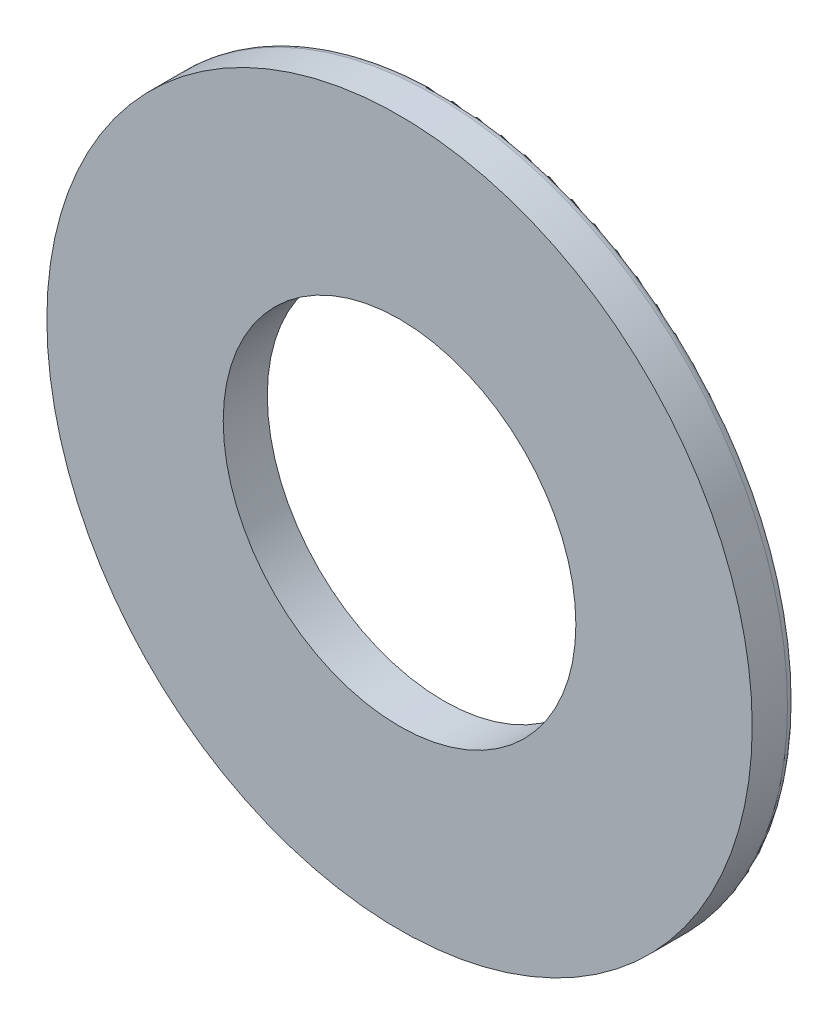
ISO-10303-21;
HEADER;
FILE_DESCRIPTION(('STEP AP214'),'2;1');
FILE_NAME('part.step','',(''),(''),'','','');
FILE_SCHEMA(('AUTOMOTIVE_DESIGN { 1 0 10303 214 1 1 1 1 }'));
ENDSEC;
DATA;
#1=APPLICATION_CONTEXT('core data for automotive mechanical design processes');
#2=APPLICATION_PROTOCOL_DEFINITION('international standard','automotive_design',2000,#1);
#3=PRODUCT_CONTEXT('',#1,'mechanical');
#4=PRODUCT('Part','Part','',(#3));
#5=PRODUCT_RELATED_PRODUCT_CATEGORY('part','',(#4));
#6=PRODUCT_DEFINITION_FORMATION('','',#4);
#7=PRODUCT_DEFINITION_CONTEXT('part definition',#1,'design');
#8=PRODUCT_DEFINITION('design','',#6,#7);
#9=PRODUCT_DEFINITION_SHAPE('','',#8);
#10=(LENGTH_UNIT() NAMED_UNIT(*) SI_UNIT(.MILLI.,.METRE.));
#11=(NAMED_UNIT(*) PLANE_ANGLE_UNIT() SI_UNIT($,.RADIAN.));
#12=(NAMED_UNIT(*) SI_UNIT($,.STERADIAN.) SOLID_ANGLE_UNIT());
#13=UNCERTAINTY_MEASURE_WITH_UNIT(LENGTH_MEASURE(1.E-05),#10,'distance_accuracy_value','');
#14=(GEOMETRIC_REPRESENTATION_CONTEXT(3) GLOBAL_UNCERTAINTY_ASSIGNED_CONTEXT((#13)) GLOBAL_UNIT_ASSIGNED_CONTEXT((#10,
#11,#12)) REPRESENTATION_CONTEXT('',''));
#15=CARTESIAN_POINT('',(0.,0.,0.));
#16=DIRECTION('',(0.,0.,1.));
#17=DIRECTION('',(1.,0.,0.));
#18=AXIS2_PLACEMENT_3D('',#15,#16,#17);
#19=CARTESIAN_POINT('',(0.,0.,0.25));
#20=DIRECTION('',(0.,0.,1.));
#21=DIRECTION('',(1.,0.,0.));
#22=AXIS2_PLACEMENT_3D('',#19,#20,#21);
#23=PLANE('',#22);
#24=CARTESIAN_POINT('',(0.,0.,0.25));
#25=DIRECTION('',(0.,0.,1.));
#26=DIRECTION('',(1.,0.,0.));
#27=AXIS2_PLACEMENT_3D('',#24,#25,#26);
#28=CIRCLE('',#27,2.);
#29=CARTESIAN_POINT('',(2.,0.,0.25));
#30=VERTEX_POINT('',#29);
#31=EDGE_CURVE('E42',#30,#30,#28,.T.);
#32=ORIENTED_EDGE('',*,*,#31,.T.);
#33=EDGE_LOOP('',(#32));
#34=FACE_BOUND('',#33,.T.);
#35=CARTESIAN_POINT('',(0.,0.,0.25));
#36=DIRECTION('',(0.,0.,1.));
#37=DIRECTION('',(1.,0.,0.));
#38=AXIS2_PLACEMENT_3D('',#35,#36,#37);
#39=CIRCLE('',#38,1.);
#40=CARTESIAN_POINT('',(1.,0.,0.25));
#41=VERTEX_POINT('',#40);
#42=EDGE_CURVE('E46',#41,#41,#39,.T.);
#43=ORIENTED_EDGE('',*,*,#42,.F.);
#44=EDGE_LOOP('',(#43));
#45=FACE_BOUND('',#44,.T.);
#46=ADVANCED_FACE('F31',(#34,#45),#23,.T.);
#47=CARTESIAN_POINT('',(0.,0.,0.));
#48=DIRECTION('',(0.,0.,1.));
#49=DIRECTION('',(1.,0.,0.));
#50=AXIS2_PLACEMENT_3D('',#47,#48,#49);
#51=PLANE('',#50);
#52=CARTESIAN_POINT('',(0.,0.,0.));
#53=DIRECTION('',(0.,0.,1.));
#54=DIRECTION('',(1.,0.,0.));
#55=AXIS2_PLACEMENT_3D('',#52,#53,#54);
#56=CIRCLE('',#55,1.95);
#57=CARTESIAN_POINT('',(1.95,0.,0.));
#58=VERTEX_POINT('',#57);
#59=EDGE_CURVE('E10',#58,#58,#56,.F.);
#60=ORIENTED_EDGE('',*,*,#59,.T.);
#61=EDGE_LOOP('',(#60));
#62=FACE_BOUND('',#61,.T.);
#63=CARTESIAN_POINT('',(0.,0.,0.));
#64=DIRECTION('',(0.,0.,1.));
#65=DIRECTION('',(1.,0.,0.));
#66=AXIS2_PLACEMENT_3D('',#63,#64,#65);
#67=CIRCLE('',#66,1.);
#68=CARTESIAN_POINT('',(1.,0.,0.));
#69=VERTEX_POINT('',#68);
#70=EDGE_CURVE('E49',#69,#69,#67,.T.);
#71=ORIENTED_EDGE('',*,*,#70,.T.);
#72=EDGE_LOOP('',(#71));
#73=FACE_BOUND('',#72,.T.);
#74=ADVANCED_FACE('F59',(#62,#73),#51,.F.);
#75=CARTESIAN_POINT('',(0.,0.,0.25));
#76=DIRECTION('',(0.,0.,-1.));
#77=DIRECTION('',(-1.,0.,0.));
#78=AXIS2_PLACEMENT_3D('',#75,#76,#77);
#79=CYLINDRICAL_SURFACE('',#78,2.);
#80=CARTESIAN_POINT('',(0.,0.,0.05));
#81=DIRECTION('',(0.,0.,1.));
#82=DIRECTION('',(1.,0.,0.));
#83=AXIS2_PLACEMENT_3D('',#80,#81,#82);
#84=CIRCLE('',#83,2.);
#85=CARTESIAN_POINT('',(2.,0.,0.05));
#86=VERTEX_POINT('',#85);
#87=EDGE_CURVE('E38',#86,#86,#84,.T.);
#88=ORIENTED_EDGE('',*,*,#87,.T.);
#89=EDGE_LOOP('',(#88));
#90=FACE_BOUND('',#89,.T.);
#91=ORIENTED_EDGE('',*,*,#31,.F.);
#92=EDGE_LOOP('',(#91));
#93=FACE_BOUND('',#92,.T.);
#94=ADVANCED_FACE('F65',(#90,#93),#79,.T.);
#95=CARTESIAN_POINT('',(0.,0.,0.25));
#96=DIRECTION('',(0.,0.,-1.));
#97=DIRECTION('',(-1.,0.,0.));
#98=AXIS2_PLACEMENT_3D('',#95,#96,#97);
#99=CYLINDRICAL_SURFACE('',#98,1.);
#100=ORIENTED_EDGE('',*,*,#42,.T.);
#101=EDGE_LOOP('',(#100));
#102=FACE_BOUND('',#101,.T.);
#103=ORIENTED_EDGE('',*,*,#70,.F.);
#104=EDGE_LOOP('',(#103));
#105=FACE_BOUND('',#104,.T.);
#106=ADVANCED_FACE('F55',(#102,#105),#99,.F.);
#107=CARTESIAN_POINT('',(0.,0.,0.05));
#108=DIRECTION('',(0.,0.,1.));
#109=DIRECTION('',(1.,0.,0.));
#110=AXIS2_PLACEMENT_3D('',#107,#108,#109);
#111=TOROIDAL_SURFACE('',#110,1.95,0.05);
#112=ORIENTED_EDGE('',*,*,#59,.F.);
#113=EDGE_LOOP('',(#112));
#114=FACE_BOUND('',#113,.T.);
#115=ORIENTED_EDGE('',*,*,#87,.F.);
#116=EDGE_LOOP('',(#115));
#117=FACE_BOUND('',#116,.T.);
#118=ADVANCED_FACE('F33',(#114,#117),#111,.T.);
#119=CLOSED_SHELL('',(#46,#74,#94,#106,#118));
#120=MANIFOLD_SOLID_BREP('B2',#119);
#121=ADVANCED_BREP_SHAPE_REPRESENTATION('',(#18,#120),#14);
#122=SHAPE_DEFINITION_REPRESENTATION(#9,#121);
ENDSEC;
END-ISO-10303-21;
